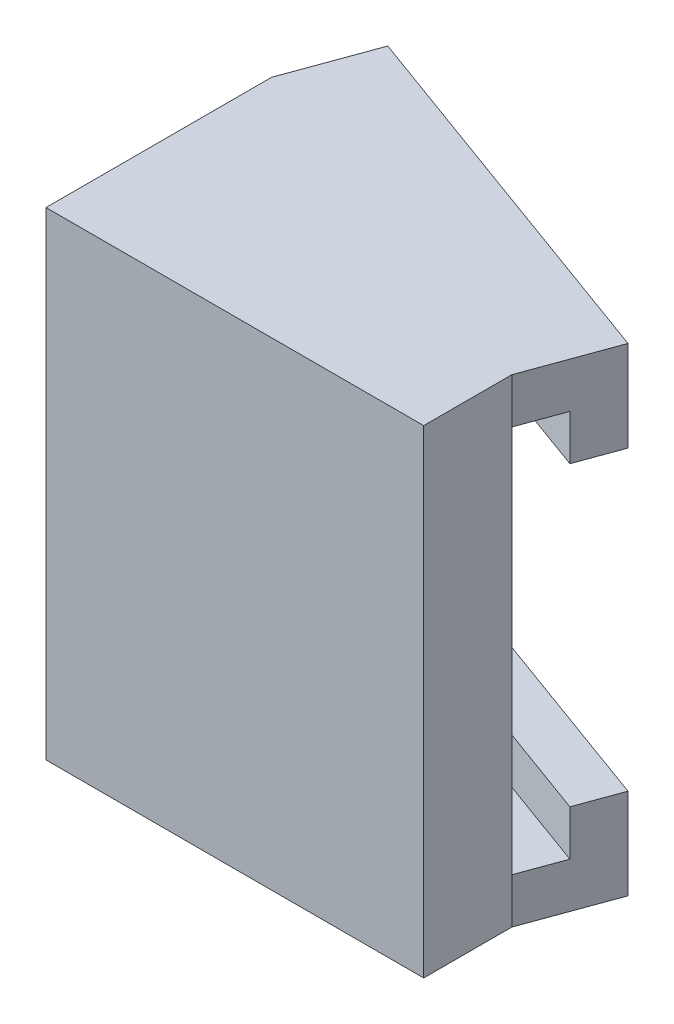
ISO-10303-21;
HEADER;
FILE_DESCRIPTION(('STEP AP214'),'2;1');
FILE_NAME('part.step','',(''),(''),'','','');
FILE_SCHEMA(('AUTOMOTIVE_DESIGN { 1 0 10303 214 1 1 1 1 }'));
ENDSEC;
DATA;
#1=APPLICATION_CONTEXT('core data for automotive mechanical design processes');
#2=APPLICATION_PROTOCOL_DEFINITION('international standard','automotive_design',2000,#1);
#3=PRODUCT_CONTEXT('',#1,'mechanical');
#4=PRODUCT('Part','Part','',(#3));
#5=PRODUCT_RELATED_PRODUCT_CATEGORY('part','',(#4));
#6=PRODUCT_DEFINITION_FORMATION('','',#4);
#7=PRODUCT_DEFINITION_CONTEXT('part definition',#1,'design');
#8=PRODUCT_DEFINITION('design','',#6,#7);
#9=PRODUCT_DEFINITION_SHAPE('','',#8);
#10=(LENGTH_UNIT() NAMED_UNIT(*) SI_UNIT(.MILLI.,.METRE.));
#11=(NAMED_UNIT(*) PLANE_ANGLE_UNIT() SI_UNIT($,.RADIAN.));
#12=(NAMED_UNIT(*) SI_UNIT($,.STERADIAN.) SOLID_ANGLE_UNIT());
#13=UNCERTAINTY_MEASURE_WITH_UNIT(LENGTH_MEASURE(1.E-05),#10,'distance_accuracy_value','');
#14=(GEOMETRIC_REPRESENTATION_CONTEXT(3) GLOBAL_UNCERTAINTY_ASSIGNED_CONTEXT((#13)) GLOBAL_UNIT_ASSIGNED_CONTEXT((#10,
#11,#12)) REPRESENTATION_CONTEXT('',''));
#15=CARTESIAN_POINT('',(0.,0.,0.));
#16=DIRECTION('',(0.,0.,1.));
#17=DIRECTION('',(1.,0.,0.));
#18=AXIS2_PLACEMENT_3D('',#15,#16,#17);
#19=CARTESIAN_POINT('',(8.73127251597239,-7.7,-3.38289343482928));
#20=DIRECTION('',(0.,-1.,0.));
#21=DIRECTION('',(0.,0.,-1.));
#22=AXIS2_PLACEMENT_3D('',#19,#20,#21);
#23=PLANE('',#22);
#24=DIRECTION('',(0.939692620785911,0.,0.342020143325662));
#25=VECTOR('',#24,1.);
#26=CARTESIAN_POINT('',(8.1156362579862,-7.7,-1.69144671741465));
#27=LINE('',#26,#25);
#28=CARTESIAN_POINT('',(-6.88436374201381,-7.7,-7.15100023140756));
#29=VERTEX_POINT('',#28);
#30=CARTESIAN_POINT('',(8.1156362579862,-7.7,-1.69144671741465));
#31=VERTEX_POINT('',#30);
#32=EDGE_CURVE('E164',#29,#31,#27,.T.);
#33=ORIENTED_EDGE('',*,*,#32,.F.);
#34=DIRECTION('',(-0.342020143325663,0.,0.93969262078591));
#35=VECTOR('',#34,1.);
#36=CARTESIAN_POINT('',(-6.26872748402761,-7.7,-8.84244694882221));
#37=LINE('',#36,#35);
#38=CARTESIAN_POINT('',(-7.5,-7.7,-5.45955351399293));
#39=VERTEX_POINT('',#38);
#40=EDGE_CURVE('E58',#29,#39,#37,.T.);
#41=ORIENTED_EDGE('',*,*,#40,.T.);
#42=DIRECTION('',(0.939692620785911,0.,0.342020143325663));
#43=VECTOR('',#42,1.);
#44=CARTESIAN_POINT('',(7.5,-7.7,0.));
#45=LINE('',#44,#43);
#46=CARTESIAN_POINT('',(7.5,-7.7,0.));
#47=VERTEX_POINT('',#46);
#48=EDGE_CURVE('E149',#39,#47,#45,.T.);
#49=ORIENTED_EDGE('',*,*,#48,.T.);
#50=DIRECTION('',(-0.342020143325663,0.,0.93969262078591));
#51=VECTOR('',#50,1.);
#52=CARTESIAN_POINT('',(8.73127251597239,-7.7,-3.38289343482928));
#53=LINE('',#52,#51);
#54=EDGE_CURVE('E50',#31,#47,#53,.T.);
#55=ORIENTED_EDGE('',*,*,#54,.F.);
#56=EDGE_LOOP('',(#33,#41,#49,#55));
#57=FACE_BOUND('',#56,.T.);
#58=ADVANCED_FACE('F34',(#57),#23,.F.);
#59=CARTESIAN_POINT('',(-6.26872748402761,7.7,-8.84244694882221));
#60=DIRECTION('',(0.,1.,0.));
#61=DIRECTION('',(-1.,0.,0.));
#62=AXIS2_PLACEMENT_3D('',#59,#60,#61);
#63=PLANE('',#62);
#64=DIRECTION('',(-0.939692620785911,0.,-0.342020143325663));
#65=VECTOR('',#64,1.);
#66=CARTESIAN_POINT('',(8.11563625798619,7.7,-1.69144671741464));
#67=LINE('',#66,#65);
#68=CARTESIAN_POINT('',(8.11563625798619,7.7,-1.69144671741464));
#69=VERTEX_POINT('',#68);
#70=CARTESIAN_POINT('',(-6.8843637420138,7.7,-7.15100023140757));
#71=VERTEX_POINT('',#70);
#72=EDGE_CURVE('E174',#69,#71,#67,.T.);
#73=ORIENTED_EDGE('',*,*,#72,.F.);
#74=DIRECTION('',(-0.342020143325663,0.,0.93969262078591));
#75=VECTOR('',#74,1.);
#76=CARTESIAN_POINT('',(8.73127251597239,7.7,-3.38289343482928));
#77=LINE('',#76,#75);
#78=CARTESIAN_POINT('',(7.5,7.7,0.));
#79=VERTEX_POINT('',#78);
#80=EDGE_CURVE('E218',#69,#79,#77,.T.);
#81=ORIENTED_EDGE('',*,*,#80,.T.);
#82=DIRECTION('',(-0.939692620785911,0.,-0.342020143325663));
#83=VECTOR('',#82,1.);
#84=CARTESIAN_POINT('',(-7.5,7.7,-5.45955351399293));
#85=LINE('',#84,#83);
#86=CARTESIAN_POINT('',(-7.5,7.7,-5.45955351399293));
#87=VERTEX_POINT('',#86);
#88=EDGE_CURVE('E205',#79,#87,#85,.T.);
#89=ORIENTED_EDGE('',*,*,#88,.T.);
#90=DIRECTION('',(-0.342020143325663,0.,0.93969262078591));
#91=VECTOR('',#90,1.);
#92=CARTESIAN_POINT('',(-6.26872748402761,7.7,-8.84244694882221));
#93=LINE('',#92,#91);
#94=EDGE_CURVE('E209',#71,#87,#93,.T.);
#95=ORIENTED_EDGE('',*,*,#94,.F.);
#96=EDGE_LOOP('',(#73,#81,#89,#95));
#97=FACE_BOUND('',#96,.T.);
#98=ADVANCED_FACE('F291',(#97),#63,.F.);
#99=CARTESIAN_POINT('',(-7.5,-9.5,-5.45955351399293));
#100=DIRECTION('',(0.342020143325663,0.,-0.939692620785911));
#101=DIRECTION('',(-0.939692620785911,0.,-0.342020143325663));
#102=AXIS2_PLACEMENT_3D('',#99,#100,#101);
#103=PLANE('',#102);
#104=DIRECTION('',(0.,1.,0.));
#105=VECTOR('',#104,1.);
#106=CARTESIAN_POINT('',(7.5,-9.5,0.));
#107=LINE('',#106,#105);
#108=EDGE_CURVE('E246',#47,#79,#107,.T.);
#109=ORIENTED_EDGE('',*,*,#108,.F.);
#110=ORIENTED_EDGE('',*,*,#48,.F.);
#111=DIRECTION('',(0.,1.,0.));
#112=VECTOR('',#111,1.);
#113=CARTESIAN_POINT('',(-7.5,-9.5,-5.45955351399293));
#114=LINE('',#113,#112);
#115=EDGE_CURVE('E242',#39,#87,#114,.T.);
#116=ORIENTED_EDGE('',*,*,#115,.T.);
#117=ORIENTED_EDGE('',*,*,#88,.F.);
#118=EDGE_LOOP('',(#109,#110,#116,#117));
#119=FACE_BOUND('',#118,.T.);
#120=ADVANCED_FACE('F290',(#119),#103,.T.);
#121=CARTESIAN_POINT('',(7.5,-9.5,3.));
#122=DIRECTION('',(-1.,0.,0.));
#123=DIRECTION('',(0.,0.,1.));
#124=AXIS2_PLACEMENT_3D('',#121,#122,#123);
#125=PLANE('',#124);
#126=CARTESIAN_POINT('',(7.5,-9.5,0.));
#127=VERTEX_POINT('',#126);
#128=EDGE_CURVE('E247',#127,#47,#107,.T.);
#129=ORIENTED_EDGE('',*,*,#128,.T.);
#130=ORIENTED_EDGE('',*,*,#108,.T.);
#131=DIRECTION('',(0.,-1.,0.));
#132=VECTOR('',#131,1.);
#133=CARTESIAN_POINT('',(7.5,9.5,0.));
#134=LINE('',#133,#132);
#135=CARTESIAN_POINT('',(7.5,9.5,0.));
#136=VERTEX_POINT('',#135);
#137=EDGE_CURVE('E212',#136,#79,#134,.T.);
#138=ORIENTED_EDGE('',*,*,#137,.F.);
#139=DIRECTION('',(0.,0.,-1.));
#140=VECTOR('',#139,1.);
#141=CARTESIAN_POINT('',(7.5,9.5,3.));
#142=LINE('',#141,#140);
#143=CARTESIAN_POINT('',(7.5,9.5,3.5));
#144=VERTEX_POINT('',#143);
#145=EDGE_CURVE('E11',#144,#136,#142,.T.);
#146=ORIENTED_EDGE('',*,*,#145,.F.);
#147=DIRECTION('',(0.,1.,0.));
#148=VECTOR('',#147,1.);
#149=CARTESIAN_POINT('',(7.5,-9.5,3.5));
#150=LINE('',#149,#148);
#151=CARTESIAN_POINT('',(7.5,-9.5,3.5));
#152=VERTEX_POINT('',#151);
#153=EDGE_CURVE('E227',#152,#144,#150,.T.);
#154=ORIENTED_EDGE('',*,*,#153,.F.);
#155=DIRECTION('',(0.,0.,-1.));
#156=VECTOR('',#155,1.);
#157=CARTESIAN_POINT('',(7.5,-9.5,3.));
#158=LINE('',#157,#156);
#159=EDGE_CURVE('E250',#152,#127,#158,.T.);
#160=ORIENTED_EDGE('',*,*,#159,.T.);
#161=EDGE_LOOP('',(#129,#130,#138,#146,#154,#160));
#162=FACE_BOUND('',#161,.T.);
#163=ADVANCED_FACE('F36',(#162),#125,.F.);
#164=CARTESIAN_POINT('',(-7.5,9.5,3.));
#165=DIRECTION('',(0.,-1.,0.));
#166=DIRECTION('',(0.,0.,-1.));
#167=AXIS2_PLACEMENT_3D('',#164,#165,#166);
#168=PLANE('',#167);
#169=ORIENTED_EDGE('',*,*,#145,.T.);
#170=DIRECTION('',(-0.342020143325663,0.,0.93969262078591));
#171=VECTOR('',#170,1.);
#172=CARTESIAN_POINT('',(8.73127251597239,9.5,-3.38289343482928));
#173=LINE('',#172,#171);
#174=CARTESIAN_POINT('',(8.73127251597239,9.5,-3.38289343482928));
#175=VERTEX_POINT('',#174);
#176=EDGE_CURVE('E220',#175,#136,#173,.T.);
#177=ORIENTED_EDGE('',*,*,#176,.F.);
#178=DIRECTION('',(0.939692620785911,0.,0.342020143325663));
#179=VECTOR('',#178,1.);
#180=CARTESIAN_POINT('',(-6.26872748402761,9.5,-8.84244694882221));
#181=LINE('',#180,#179);
#182=CARTESIAN_POINT('',(-6.26872748402761,9.5,-8.84244694882221));
#183=VERTEX_POINT('',#182);
#184=EDGE_CURVE('E204',#183,#175,#181,.T.);
#185=ORIENTED_EDGE('',*,*,#184,.F.);
#186=DIRECTION('',(-0.342020143325663,0.,0.93969262078591));
#187=VECTOR('',#186,1.);
#188=CARTESIAN_POINT('',(-6.26872748402761,9.5,-8.84244694882221));
#189=LINE('',#188,#187);
#190=CARTESIAN_POINT('',(-7.5,9.5,-5.45955351399293));
#191=VERTEX_POINT('',#190);
#192=EDGE_CURVE('E222',#183,#191,#189,.T.);
#193=ORIENTED_EDGE('',*,*,#192,.T.);
#194=DIRECTION('',(0.,0.,-1.));
#195=VECTOR('',#194,1.);
#196=CARTESIAN_POINT('',(-7.5,9.5,3.));
#197=LINE('',#196,#195);
#198=CARTESIAN_POINT('',(-7.5,9.5,3.5));
#199=VERTEX_POINT('',#198);
#200=EDGE_CURVE('E43',#199,#191,#197,.T.);
#201=ORIENTED_EDGE('',*,*,#200,.F.);
#202=DIRECTION('',(-1.,0.,0.));
#203=VECTOR('',#202,1.);
#204=CARTESIAN_POINT('',(7.5,9.5,3.5));
#205=LINE('',#204,#203);
#206=EDGE_CURVE('E230',#144,#199,#205,.T.);
#207=ORIENTED_EDGE('',*,*,#206,.F.);
#208=EDGE_LOOP('',(#169,#177,#185,#193,#201,#207));
#209=FACE_BOUND('',#208,.T.);
#210=ADVANCED_FACE('F262',(#209),#168,.F.);
#211=CARTESIAN_POINT('',(-7.5,-9.5,3.));
#212=DIRECTION('',(1.,0.,0.));
#213=DIRECTION('',(0.,0.,-1.));
#214=AXIS2_PLACEMENT_3D('',#211,#212,#213);
#215=PLANE('',#214);
#216=ORIENTED_EDGE('',*,*,#200,.T.);
#217=DIRECTION('',(0.,1.,0.));
#218=VECTOR('',#217,1.);
#219=CARTESIAN_POINT('',(-7.5,9.5,-5.45955351399293));
#220=LINE('',#219,#218);
#221=EDGE_CURVE('E200',#87,#191,#220,.T.);
#222=ORIENTED_EDGE('',*,*,#221,.F.);
#223=ORIENTED_EDGE('',*,*,#115,.F.);
#224=CARTESIAN_POINT('',(-7.5,-9.5,-5.45955351399293));
#225=VERTEX_POINT('',#224);
#226=EDGE_CURVE('E243',#225,#39,#114,.T.);
#227=ORIENTED_EDGE('',*,*,#226,.F.);
#228=DIRECTION('',(0.,0.,-1.));
#229=VECTOR('',#228,1.);
#230=CARTESIAN_POINT('',(-7.5,-9.5,3.));
#231=LINE('',#230,#229);
#232=CARTESIAN_POINT('',(-7.5,-9.5,3.5));
#233=VERTEX_POINT('',#232);
#234=EDGE_CURVE('E252',#233,#225,#231,.T.);
#235=ORIENTED_EDGE('',*,*,#234,.F.);
#236=DIRECTION('',(0.,-1.,0.));
#237=VECTOR('',#236,1.);
#238=CARTESIAN_POINT('',(-7.5,9.5,3.5));
#239=LINE('',#238,#237);
#240=EDGE_CURVE('E233',#199,#233,#239,.T.);
#241=ORIENTED_EDGE('',*,*,#240,.F.);
#242=EDGE_LOOP('',(#216,#222,#223,#227,#235,#241));
#243=FACE_BOUND('',#242,.T.);
#244=ADVANCED_FACE('F258',(#243),#215,.F.);
#245=CARTESIAN_POINT('',(-7.5,-9.5,3.));
#246=DIRECTION('',(0.,1.,0.));
#247=DIRECTION('',(0.,0.,1.));
#248=AXIS2_PLACEMENT_3D('',#245,#246,#247);
#249=PLANE('',#248);
#250=ORIENTED_EDGE('',*,*,#234,.T.);
#251=DIRECTION('',(-0.342020143325663,0.,0.93969262078591));
#252=VECTOR('',#251,1.);
#253=CARTESIAN_POINT('',(-6.26872748402761,-9.5,-8.84244694882221));
#254=LINE('',#253,#252);
#255=CARTESIAN_POINT('',(-6.26872748402761,-9.5,-8.84244694882221));
#256=VERTEX_POINT('',#255);
#257=EDGE_CURVE('E196',#256,#225,#254,.T.);
#258=ORIENTED_EDGE('',*,*,#257,.F.);
#259=DIRECTION('',(-0.939692620785911,0.,-0.342020143325663));
#260=VECTOR('',#259,1.);
#261=CARTESIAN_POINT('',(8.73127251597239,-9.5,-3.38289343482928));
#262=LINE('',#261,#260);
#263=CARTESIAN_POINT('',(8.73127251597239,-9.5,-3.38289343482928));
#264=VERTEX_POINT('',#263);
#265=EDGE_CURVE('E148',#264,#256,#262,.T.);
#266=ORIENTED_EDGE('',*,*,#265,.F.);
#267=DIRECTION('',(-0.342020143325663,0.,0.93969262078591));
#268=VECTOR('',#267,1.);
#269=CARTESIAN_POINT('',(8.73127251597239,-9.5,-3.38289343482928));
#270=LINE('',#269,#268);
#271=EDGE_CURVE('E146',#264,#127,#270,.T.);
#272=ORIENTED_EDGE('',*,*,#271,.T.);
#273=ORIENTED_EDGE('',*,*,#159,.F.);
#274=DIRECTION('',(1.,0.,0.));
#275=VECTOR('',#274,1.);
#276=CARTESIAN_POINT('',(-7.5,-9.5,3.5));
#277=LINE('',#276,#275);
#278=EDGE_CURVE('E224',#233,#152,#277,.T.);
#279=ORIENTED_EDGE('',*,*,#278,.F.);
#280=EDGE_LOOP('',(#250,#258,#266,#272,#273,#279));
#281=FACE_BOUND('',#280,.T.);
#282=ADVANCED_FACE('F299',(#281),#249,.F.);
#283=CARTESIAN_POINT('',(0.,0.,3.5));
#284=DIRECTION('',(0.,0.,1.));
#285=DIRECTION('',(1.,0.,0.));
#286=AXIS2_PLACEMENT_3D('',#283,#284,#285);
#287=PLANE('',#286);
#288=ORIENTED_EDGE('',*,*,#278,.T.);
#289=ORIENTED_EDGE('',*,*,#153,.T.);
#290=ORIENTED_EDGE('',*,*,#206,.T.);
#291=ORIENTED_EDGE('',*,*,#240,.T.);
#292=EDGE_LOOP('',(#288,#289,#290,#291));
#293=FACE_BOUND('',#292,.T.);
#294=ADVANCED_FACE('F265',(#293),#287,.T.);
#295=CARTESIAN_POINT('',(-6.26872748402761,9.5,-8.84244694882221));
#296=DIRECTION('',(0.939692620785911,0.,0.342020143325663));
#297=DIRECTION('',(0.342020143325663,0.,-0.939692620785911));
#298=AXIS2_PLACEMENT_3D('',#295,#296,#297);
#299=PLANE('',#298);
#300=ORIENTED_EDGE('',*,*,#221,.T.);
#301=ORIENTED_EDGE('',*,*,#192,.F.);
#302=DIRECTION('',(0.,1.,0.));
#303=VECTOR('',#302,1.);
#304=CARTESIAN_POINT('',(-6.26872748402761,9.5,-8.84244694882221));
#305=LINE('',#304,#303);
#306=CARTESIAN_POINT('',(-6.26872748402761,5.9,-8.84244694882221));
#307=VERTEX_POINT('',#306);
#308=EDGE_CURVE('E201',#307,#183,#305,.T.);
#309=ORIENTED_EDGE('',*,*,#308,.F.);
#310=DIRECTION('',(0.342020143325662,0.,-0.939692620785911));
#311=VECTOR('',#310,1.);
#312=CARTESIAN_POINT('',(-6.8843637420138,5.9,-7.15100023140757));
#313=LINE('',#312,#311);
#314=CARTESIAN_POINT('',(-6.8843637420138,5.9,-7.15100023140757));
#315=VERTEX_POINT('',#314);
#316=EDGE_CURVE('E182',#315,#307,#313,.T.);
#317=ORIENTED_EDGE('',*,*,#316,.F.);
#318=DIRECTION('',(0.,1.,0.));
#319=VECTOR('',#318,1.);
#320=CARTESIAN_POINT('',(-6.8843637420138,5.9,-7.15100023140757));
#321=LINE('',#320,#319);
#322=EDGE_CURVE('E185',#315,#71,#321,.T.);
#323=ORIENTED_EDGE('',*,*,#322,.T.);
#324=ORIENTED_EDGE('',*,*,#94,.T.);
#325=EDGE_LOOP('',(#300,#301,#309,#317,#323,#324));
#326=FACE_BOUND('',#325,.T.);
#327=ADVANCED_FACE('F282',(#326),#299,.F.);
#328=CARTESIAN_POINT('',(8.73127251597239,9.5,-3.38289343482928));
#329=DIRECTION('',(-0.93969262078591,0.,-0.342020143325663));
#330=DIRECTION('',(-0.342020143325663,0.,0.939692620785911));
#331=AXIS2_PLACEMENT_3D('',#328,#329,#330);
#332=PLANE('',#331);
#333=ORIENTED_EDGE('',*,*,#137,.T.);
#334=ORIENTED_EDGE('',*,*,#80,.F.);
#335=DIRECTION('',(0.,1.,0.));
#336=VECTOR('',#335,1.);
#337=CARTESIAN_POINT('',(8.11563625798619,5.9,-1.69144671741464));
#338=LINE('',#337,#336);
#339=CARTESIAN_POINT('',(8.11563625798619,5.9,-1.69144671741464));
#340=VERTEX_POINT('',#339);
#341=EDGE_CURVE('E189',#340,#69,#338,.T.);
#342=ORIENTED_EDGE('',*,*,#341,.F.);
#343=DIRECTION('',(-0.342020143325663,0.,0.93969262078591));
#344=VECTOR('',#343,1.);
#345=CARTESIAN_POINT('',(8.73127251597239,5.9,-3.38289343482928));
#346=LINE('',#345,#344);
#347=CARTESIAN_POINT('',(8.73127251597239,5.9,-3.38289343482928));
#348=VERTEX_POINT('',#347);
#349=EDGE_CURVE('E178',#348,#340,#346,.T.);
#350=ORIENTED_EDGE('',*,*,#349,.F.);
#351=DIRECTION('',(0.,-1.,0.));
#352=VECTOR('',#351,1.);
#353=CARTESIAN_POINT('',(8.73127251597239,9.5,-3.38289343482928));
#354=LINE('',#353,#352);
#355=EDGE_CURVE('E207',#175,#348,#354,.T.);
#356=ORIENTED_EDGE('',*,*,#355,.F.);
#357=ORIENTED_EDGE('',*,*,#176,.T.);
#358=EDGE_LOOP('',(#333,#334,#342,#350,#356,#357));
#359=FACE_BOUND('',#358,.T.);
#360=ADVANCED_FACE('F275',(#359),#332,.F.);
#361=CARTESIAN_POINT('',(2.10860585427619,0.,-5.79334697115377));
#362=DIRECTION('',(-0.342020143325663,0.,0.939692620785911));
#363=DIRECTION('',(0.939692620785911,0.,0.342020143325663));
#364=AXIS2_PLACEMENT_3D('',#361,#362,#363);
#365=PLANE('',#364);
#366=ORIENTED_EDGE('',*,*,#308,.T.);
#367=ORIENTED_EDGE('',*,*,#184,.T.);
#368=ORIENTED_EDGE('',*,*,#355,.T.);
#369=DIRECTION('',(0.939692620785911,0.,0.342020143325663));
#370=VECTOR('',#369,1.);
#371=CARTESIAN_POINT('',(-6.26872748402761,5.9,-8.84244694882221));
#372=LINE('',#371,#370);
#373=EDGE_CURVE('E175',#307,#348,#372,.T.);
#374=ORIENTED_EDGE('',*,*,#373,.F.);
#375=EDGE_LOOP('',(#366,#367,#368,#374));
#376=FACE_BOUND('',#375,.T.);
#377=ADVANCED_FACE('F279',(#376),#365,.F.);
#378=CARTESIAN_POINT('',(8.73127251597239,-9.5,-3.38289343482928));
#379=DIRECTION('',(-0.939692620785911,0.,-0.342020143325663));
#380=DIRECTION('',(-0.342020143325663,0.,0.939692620785911));
#381=AXIS2_PLACEMENT_3D('',#378,#379,#380);
#382=PLANE('',#381);
#383=ORIENTED_EDGE('',*,*,#128,.F.);
#384=ORIENTED_EDGE('',*,*,#271,.F.);
#385=DIRECTION('',(0.,-1.,0.));
#386=VECTOR('',#385,1.);
#387=CARTESIAN_POINT('',(8.73127251597239,-9.5,-3.38289343482928));
#388=LINE('',#387,#386);
#389=CARTESIAN_POINT('',(8.73127251597239,-5.9,-3.38289343482928));
#390=VERTEX_POINT('',#389);
#391=EDGE_CURVE('E140',#390,#264,#388,.T.);
#392=ORIENTED_EDGE('',*,*,#391,.F.);
#393=DIRECTION('',(0.342020143325662,0.,-0.939692620785911));
#394=VECTOR('',#393,1.);
#395=CARTESIAN_POINT('',(8.73127251597239,-5.9,-3.38289343482928));
#396=LINE('',#395,#394);
#397=CARTESIAN_POINT('',(8.1156362579862,-5.9,-1.69144671741465));
#398=VERTEX_POINT('',#397);
#399=EDGE_CURVE('E144',#398,#390,#396,.T.);
#400=ORIENTED_EDGE('',*,*,#399,.F.);
#401=DIRECTION('',(0.,-1.,0.));
#402=VECTOR('',#401,1.);
#403=CARTESIAN_POINT('',(8.1156362579862,-5.9,-1.69144671741465));
#404=LINE('',#403,#402);
#405=EDGE_CURVE('E169',#398,#31,#404,.T.);
#406=ORIENTED_EDGE('',*,*,#405,.T.);
#407=ORIENTED_EDGE('',*,*,#54,.T.);
#408=EDGE_LOOP('',(#383,#384,#392,#400,#406,#407));
#409=FACE_BOUND('',#408,.T.);
#410=ADVANCED_FACE('F142',(#409),#382,.F.);
#411=CARTESIAN_POINT('',(-6.26872748402761,-9.5,-8.84244694882221));
#412=DIRECTION('',(0.939692620785911,0.,0.342020143325663));
#413=DIRECTION('',(0.342020143325663,0.,-0.939692620785911));
#414=AXIS2_PLACEMENT_3D('',#411,#412,#413);
#415=PLANE('',#414);
#416=ORIENTED_EDGE('',*,*,#226,.T.);
#417=ORIENTED_EDGE('',*,*,#40,.F.);
#418=DIRECTION('',(0.,-1.,0.));
#419=VECTOR('',#418,1.);
#420=CARTESIAN_POINT('',(-6.88436374201381,-5.9,-7.15100023140756));
#421=LINE('',#420,#419);
#422=CARTESIAN_POINT('',(-6.88436374201381,-5.9,-7.15100023140756));
#423=VERTEX_POINT('',#422);
#424=EDGE_CURVE('E172',#423,#29,#421,.T.);
#425=ORIENTED_EDGE('',*,*,#424,.F.);
#426=DIRECTION('',(-0.342020143325663,0.,0.939692620785911));
#427=VECTOR('',#426,1.);
#428=CARTESIAN_POINT('',(-6.88436374201381,-5.9,-7.15100023140756));
#429=LINE('',#428,#427);
#430=CARTESIAN_POINT('',(-6.26872748402761,-5.9,-8.84244694882221));
#431=VERTEX_POINT('',#430);
#432=EDGE_CURVE('E158',#431,#423,#429,.T.);
#433=ORIENTED_EDGE('',*,*,#432,.F.);
#434=DIRECTION('',(0.,1.,0.));
#435=VECTOR('',#434,1.);
#436=CARTESIAN_POINT('',(-6.26872748402761,-9.5,-8.84244694882221));
#437=LINE('',#436,#435);
#438=EDGE_CURVE('E155',#256,#431,#437,.T.);
#439=ORIENTED_EDGE('',*,*,#438,.F.);
#440=ORIENTED_EDGE('',*,*,#257,.T.);
#441=EDGE_LOOP('',(#416,#417,#425,#433,#439,#440));
#442=FACE_BOUND('',#441,.T.);
#443=ADVANCED_FACE('F296',(#442),#415,.F.);
#444=CARTESIAN_POINT('',(2.10860585427619,0.,-5.79334697115377));
#445=DIRECTION('',(-0.342020143325663,0.,0.939692620785911));
#446=DIRECTION('',(0.939692620785911,0.,0.342020143325663));
#447=AXIS2_PLACEMENT_3D('',#444,#445,#446);
#448=PLANE('',#447);
#449=ORIENTED_EDGE('',*,*,#391,.T.);
#450=ORIENTED_EDGE('',*,*,#265,.T.);
#451=ORIENTED_EDGE('',*,*,#438,.T.);
#452=DIRECTION('',(-0.939692620785911,0.,-0.342020143325663));
#453=VECTOR('',#452,1.);
#454=CARTESIAN_POINT('',(-6.26872748402761,-5.9,-8.84244694882221));
#455=LINE('',#454,#453);
#456=EDGE_CURVE('E152',#390,#431,#455,.T.);
#457=ORIENTED_EDGE('',*,*,#456,.F.);
#458=EDGE_LOOP('',(#449,#450,#451,#457));
#459=FACE_BOUND('',#458,.T.);
#460=ADVANCED_FACE('F153',(#459),#448,.F.);
#461=CARTESIAN_POINT('',(8.11563625798619,5.9,-1.69144671741464));
#462=DIRECTION('',(0.342020143325663,0.,-0.939692620785911));
#463=DIRECTION('',(-0.939692620785911,0.,-0.342020143325663));
#464=AXIS2_PLACEMENT_3D('',#461,#462,#463);
#465=PLANE('',#464);
#466=ORIENTED_EDGE('',*,*,#72,.T.);
#467=ORIENTED_EDGE('',*,*,#322,.F.);
#468=DIRECTION('',(-0.939692620785911,0.,-0.342020143325663));
#469=VECTOR('',#468,1.);
#470=CARTESIAN_POINT('',(8.11563625798619,5.9,-1.69144671741464));
#471=LINE('',#470,#469);
#472=EDGE_CURVE('E180',#340,#315,#471,.T.);
#473=ORIENTED_EDGE('',*,*,#472,.F.);
#474=ORIENTED_EDGE('',*,*,#341,.T.);
#475=EDGE_LOOP('',(#466,#467,#473,#474));
#476=FACE_BOUND('',#475,.T.);
#477=ADVANCED_FACE('F394',(#476),#465,.F.);
#478=CARTESIAN_POINT('',(0.,5.9,0.));
#479=DIRECTION('',(0.,-1.,0.));
#480=DIRECTION('',(1.,0.,0.));
#481=AXIS2_PLACEMENT_3D('',#478,#479,#480);
#482=PLANE('',#481);
#483=ORIENTED_EDGE('',*,*,#373,.T.);
#484=ORIENTED_EDGE('',*,*,#349,.T.);
#485=ORIENTED_EDGE('',*,*,#472,.T.);
#486=ORIENTED_EDGE('',*,*,#316,.T.);
#487=EDGE_LOOP('',(#483,#484,#485,#486));
#488=FACE_BOUND('',#487,.T.);
#489=ADVANCED_FACE('F398',(#488),#482,.T.);
#490=CARTESIAN_POINT('',(8.1156362579862,-5.9,-1.69144671741465));
#491=DIRECTION('',(0.342020143325662,0.,-0.939692620785911));
#492=DIRECTION('',(-0.939692620785911,0.,-0.342020143325662));
#493=AXIS2_PLACEMENT_3D('',#490,#491,#492);
#494=PLANE('',#493);
#495=ORIENTED_EDGE('',*,*,#32,.T.);
#496=ORIENTED_EDGE('',*,*,#405,.F.);
#497=DIRECTION('',(0.939692620785911,0.,0.342020143325662));
#498=VECTOR('',#497,1.);
#499=CARTESIAN_POINT('',(8.1156362579862,-5.9,-1.69144671741465));
#500=LINE('',#499,#498);
#501=EDGE_CURVE('E162',#423,#398,#500,.T.);
#502=ORIENTED_EDGE('',*,*,#501,.F.);
#503=ORIENTED_EDGE('',*,*,#424,.T.);
#504=EDGE_LOOP('',(#495,#496,#502,#503));
#505=FACE_BOUND('',#504,.T.);
#506=ADVANCED_FACE('F407',(#505),#494,.F.);
#507=CARTESIAN_POINT('',(0.,-5.9,0.));
#508=DIRECTION('',(0.,-1.,0.));
#509=DIRECTION('',(0.,0.,-1.));
#510=AXIS2_PLACEMENT_3D('',#507,#508,#509);
#511=PLANE('',#510);
#512=ORIENTED_EDGE('',*,*,#399,.T.);
#513=ORIENTED_EDGE('',*,*,#456,.T.);
#514=ORIENTED_EDGE('',*,*,#432,.T.);
#515=ORIENTED_EDGE('',*,*,#501,.T.);
#516=EDGE_LOOP('',(#512,#513,#514,#515));
#517=FACE_BOUND('',#516,.T.);
#518=ADVANCED_FACE('F160',(#517),#511,.F.);
#519=CLOSED_SHELL('',(#58,#98,#120,#163,#210,#244,#282,#294,#327,#360,#377,#410,#443,#460,#477,
#489,#506,#518));
#520=CARTESIAN_POINT('',(0.,0.,0.));
#521=DIRECTION('',(0.,0.,1.));
#522=DIRECTION('',(1.,0.,0.));
#523=AXIS2_PLACEMENT_3D('',#520,#521,#522);
#524=PLANE('',#523);
#525=CARTESIAN_POINT('',(0.,0.,0.));
#526=DIRECTION('',(0.,0.,1.));
#527=DIRECTION('',(1.,0.,0.));
#528=AXIS2_PLACEMENT_3D('',#525,#526,#527);
#529=CIRCLE('',#528,3.);
#530=CARTESIAN_POINT('',(3.,0.,0.));
#531=VERTEX_POINT('',#530);
#532=EDGE_CURVE('E239',#531,#531,#529,.T.);
#533=ORIENTED_EDGE('',*,*,#532,.T.);
#534=EDGE_LOOP('',(#533));
#535=FACE_BOUND('',#534,.T.);
#536=ADVANCED_FACE('F334',(#535),#524,.T.);
#537=CARTESIAN_POINT('',(0.,0.,0.));
#538=DIRECTION('',(0.,0.,1.));
#539=DIRECTION('',(1.,0.,0.));
#540=AXIS2_PLACEMENT_3D('',#537,#538,#539);
#541=CYLINDRICAL_SURFACE('',#540,3.);
#542=ORIENTED_EDGE('',*,*,#532,.F.);
#543=EDGE_LOOP('',(#542));
#544=FACE_BOUND('',#543,.T.);
#545=CARTESIAN_POINT('',(0.,0.,3.));
#546=DIRECTION('',(0.,0.,1.));
#547=DIRECTION('',(1.,0.,0.));
#548=AXIS2_PLACEMENT_3D('',#545,#546,#547);
#549=CIRCLE('',#548,3.);
#550=CARTESIAN_POINT('',(3.,0.,3.));
#551=VERTEX_POINT('',#550);
#552=EDGE_CURVE('E236',#551,#551,#549,.F.);
#553=ORIENTED_EDGE('',*,*,#552,.F.);
#554=EDGE_LOOP('',(#553));
#555=FACE_BOUND('',#554,.T.);
#556=ADVANCED_FACE('F331',(#544,#555),#541,.F.);
#557=CARTESIAN_POINT('',(0.,0.,3.));
#558=DIRECTION('',(0.,0.,1.));
#559=DIRECTION('',(1.,0.,0.));
#560=AXIS2_PLACEMENT_3D('',#557,#558,#559);
#561=PLANE('',#560);
#562=ORIENTED_EDGE('',*,*,#552,.T.);
#563=EDGE_LOOP('',(#562));
#564=FACE_BOUND('',#563,.T.);
#565=ADVANCED_FACE('F328',(#564),#561,.F.);
#566=CLOSED_SHELL('',(#536,#556,#565));
#567=ORIENTED_CLOSED_SHELL('',*,#566,.T.);
#568=BREP_WITH_VOIDS('B2',#519,(#567));
#569=ADVANCED_BREP_SHAPE_REPRESENTATION('',(#18,#568),#14);
#570=SHAPE_DEFINITION_REPRESENTATION(#9,#569);
ENDSEC;
END-ISO-10303-21;
